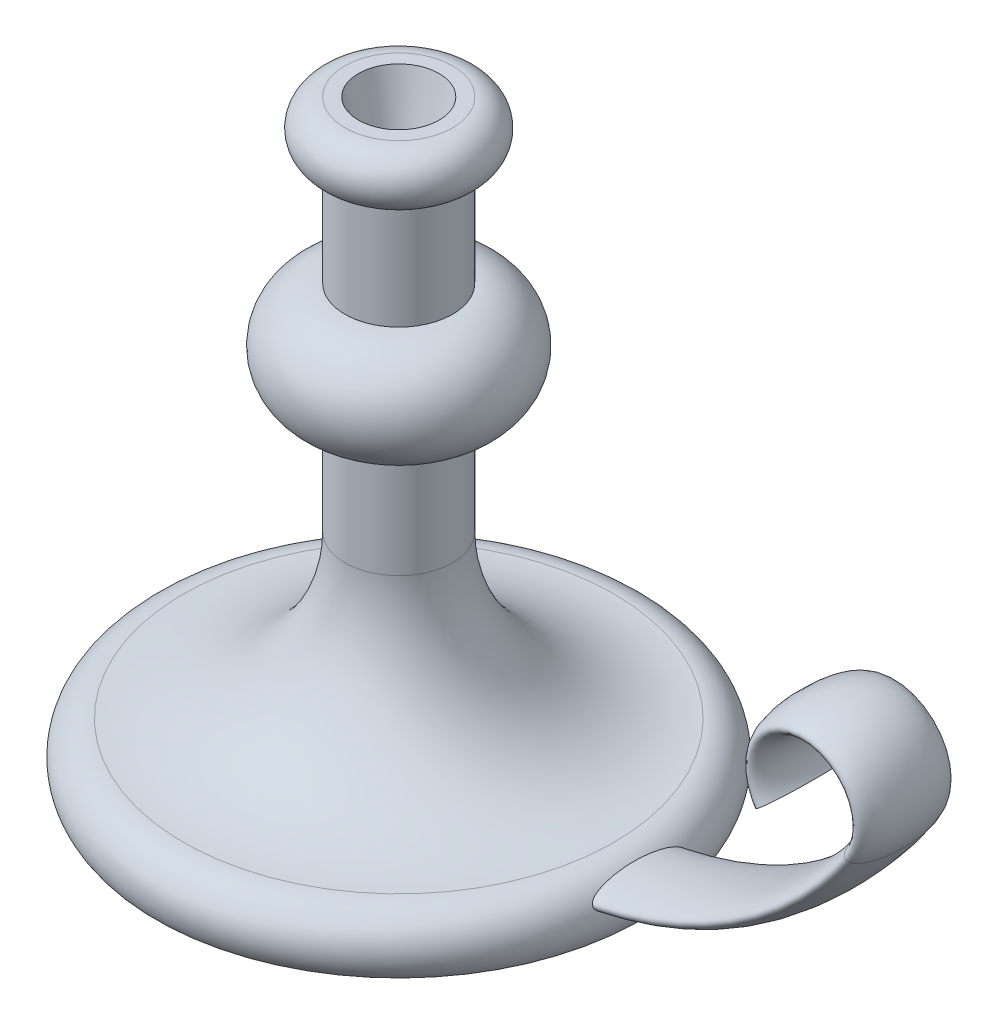
ISO-10303-21;
HEADER;
FILE_DESCRIPTION(('STEP AP214'),'2;1');
FILE_NAME('part.step','',(''),(''),'','','');
FILE_SCHEMA(('AUTOMOTIVE_DESIGN { 1 0 10303 214 1 1 1 1 }'));
ENDSEC;
DATA;
#1=APPLICATION_CONTEXT('core data for automotive mechanical design processes');
#2=APPLICATION_PROTOCOL_DEFINITION('international standard','automotive_design',2000,#1);
#3=PRODUCT_CONTEXT('',#1,'mechanical');
#4=PRODUCT('Part','Part','',(#3));
#5=PRODUCT_RELATED_PRODUCT_CATEGORY('part','',(#4));
#6=PRODUCT_DEFINITION_FORMATION('','',#4);
#7=PRODUCT_DEFINITION_CONTEXT('part definition',#1,'design');
#8=PRODUCT_DEFINITION('design','',#6,#7);
#9=PRODUCT_DEFINITION_SHAPE('','',#8);
#10=(LENGTH_UNIT() NAMED_UNIT(*) SI_UNIT(.MILLI.,.METRE.));
#11=(NAMED_UNIT(*) PLANE_ANGLE_UNIT() SI_UNIT($,.RADIAN.));
#12=(NAMED_UNIT(*) SI_UNIT($,.STERADIAN.) SOLID_ANGLE_UNIT());
#13=UNCERTAINTY_MEASURE_WITH_UNIT(LENGTH_MEASURE(1.E-05),#10,'distance_accuracy_value','');
#14=(GEOMETRIC_REPRESENTATION_CONTEXT(3) GLOBAL_UNCERTAINTY_ASSIGNED_CONTEXT((#13)) GLOBAL_UNIT_ASSIGNED_CONTEXT((#10,
#11,#12)) REPRESENTATION_CONTEXT('',''));
#15=CARTESIAN_POINT('',(0.,0.,0.));
#16=DIRECTION('',(0.,0.,1.));
#17=DIRECTION('',(1.,0.,0.));
#18=AXIS2_PLACEMENT_3D('',#15,#16,#17);
#19=CARTESIAN_POINT('',(0.,0.,0.));
#20=DIRECTION('',(0.,-1.,0.));
#21=DIRECTION('',(0.,0.,-1.));
#22=AXIS2_PLACEMENT_3D('',#19,#20,#21);
#23=PLANE('',#22);
#24=CARTESIAN_POINT('',(0.,0.,0.));
#25=DIRECTION('',(0.,-1.,0.));
#26=DIRECTION('',(0.,0.,-1.));
#27=AXIS2_PLACEMENT_3D('',#24,#25,#26);
#28=CIRCLE('',#27,90.);
#29=CARTESIAN_POINT('',(0.,0.,-90.));
#30=VERTEX_POINT('',#29);
#31=EDGE_CURVE('E67',#30,#30,#28,.T.);
#32=ORIENTED_EDGE('',*,*,#31,.T.);
#33=EDGE_LOOP('',(#32));
#34=FACE_BOUND('',#33,.T.);
#35=ADVANCED_FACE('F35',(#34),#23,.T.);
#36=CARTESIAN_POINT('',(0.,220.,0.));
#37=DIRECTION('',(0.,1.,0.));
#38=DIRECTION('',(0.,0.,1.));
#39=AXIS2_PLACEMENT_3D('',#36,#37,#38);
#40=PLANE('',#39);
#41=CARTESIAN_POINT('',(0.,220.,0.));
#42=DIRECTION('',(0.,1.,0.));
#43=DIRECTION('',(0.,0.,1.));
#44=AXIS2_PLACEMENT_3D('',#41,#42,#43);
#45=CIRCLE('',#44,15.);
#46=CARTESIAN_POINT('',(0.,220.,15.));
#47=VERTEX_POINT('',#46);
#48=EDGE_CURVE('E122',#47,#47,#45,.T.);
#49=ORIENTED_EDGE('',*,*,#48,.F.);
#50=EDGE_LOOP('',(#49));
#51=FACE_BOUND('',#50,.T.);
#52=CARTESIAN_POINT('',(0.,220.,0.));
#53=DIRECTION('',(0.,-1.,0.));
#54=DIRECTION('',(0.,0.,-1.));
#55=AXIS2_PLACEMENT_3D('',#52,#53,#54);
#56=CIRCLE('',#55,20.);
#57=CARTESIAN_POINT('',(0.,220.,-20.));
#58=VERTEX_POINT('',#57);
#59=EDGE_CURVE('E45',#58,#58,#56,.T.);
#60=ORIENTED_EDGE('',*,*,#59,.F.);
#61=EDGE_LOOP('',(#60));
#62=FACE_BOUND('',#61,.T.);
#63=ADVANCED_FACE('F110',(#51,#62),#40,.T.);
#64=CARTESIAN_POINT('',(0.,210.,0.));
#65=DIRECTION('',(0.,-1.,0.));
#66=DIRECTION('',(0.,0.,-1.));
#67=AXIS2_PLACEMENT_3D('',#64,#65,#66);
#68=TOROIDAL_SURFACE('',#67,20.,10.);
#69=ORIENTED_EDGE('',*,*,#59,.T.);
#70=EDGE_LOOP('',(#69));
#71=FACE_BOUND('',#70,.T.);
#72=CARTESIAN_POINT('',(0.,200.,0.));
#73=DIRECTION('',(0.,-1.,0.));
#74=DIRECTION('',(0.,0.,-1.));
#75=AXIS2_PLACEMENT_3D('',#72,#73,#74);
#76=CIRCLE('',#75,20.);
#77=CARTESIAN_POINT('',(0.,200.,-20.));
#78=VERTEX_POINT('',#77);
#79=EDGE_CURVE('E49',#78,#78,#76,.T.);
#80=ORIENTED_EDGE('',*,*,#79,.F.);
#81=EDGE_LOOP('',(#80));
#82=FACE_BOUND('',#81,.T.);
#83=ADVANCED_FACE('F107',(#71,#82),#68,.T.);
#84=CARTESIAN_POINT('',(0.,0.,0.));
#85=DIRECTION('',(0.,-1.,0.));
#86=DIRECTION('',(0.,0.,-1.));
#87=AXIS2_PLACEMENT_3D('',#84,#85,#86);
#88=CYLINDRICAL_SURFACE('',#87,20.);
#89=ORIENTED_EDGE('',*,*,#79,.T.);
#90=EDGE_LOOP('',(#89));
#91=FACE_BOUND('',#90,.T.);
#92=CARTESIAN_POINT('',(0.,160.,0.));
#93=DIRECTION('',(0.,-1.,0.));
#94=DIRECTION('',(0.,0.,-1.));
#95=AXIS2_PLACEMENT_3D('',#92,#93,#94);
#96=CIRCLE('',#95,20.);
#97=CARTESIAN_POINT('',(0.,160.,-20.));
#98=VERTEX_POINT('',#97);
#99=EDGE_CURVE('E53',#98,#98,#96,.T.);
#100=ORIENTED_EDGE('',*,*,#99,.F.);
#101=EDGE_LOOP('',(#100));
#102=FACE_BOUND('',#101,.T.);
#103=ADVANCED_FACE('F103',(#91,#102),#88,.T.);
#104=CARTESIAN_POINT('',(0.,140.,0.));
#105=DIRECTION('',(0.,-1.,0.));
#106=DIRECTION('',(0.,0.,-1.));
#107=AXIS2_PLACEMENT_3D('',#104,#105,#106);
#108=TOROIDAL_SURFACE('',#107,20.,20.);
#109=ORIENTED_EDGE('',*,*,#99,.T.);
#110=EDGE_LOOP('',(#109));
#111=FACE_BOUND('',#110,.T.);
#112=CARTESIAN_POINT('',(0.,120.,0.));
#113=DIRECTION('',(0.,-1.,0.));
#114=DIRECTION('',(0.,0.,-1.));
#115=AXIS2_PLACEMENT_3D('',#112,#113,#114);
#116=CIRCLE('',#115,20.);
#117=CARTESIAN_POINT('',(0.,120.,-20.));
#118=VERTEX_POINT('',#117);
#119=EDGE_CURVE('E58',#118,#118,#116,.T.);
#120=ORIENTED_EDGE('',*,*,#119,.F.);
#121=EDGE_LOOP('',(#120));
#122=FACE_BOUND('',#121,.T.);
#123=ADVANCED_FACE('F99',(#111,#122),#108,.T.);
#124=CARTESIAN_POINT('',(0.,0.,0.));
#125=DIRECTION('',(0.,-1.,0.));
#126=DIRECTION('',(0.,0.,-1.));
#127=AXIS2_PLACEMENT_3D('',#124,#125,#126);
#128=CYLINDRICAL_SURFACE('',#127,20.);
#129=ORIENTED_EDGE('',*,*,#119,.T.);
#130=EDGE_LOOP('',(#129));
#131=FACE_BOUND('',#130,.T.);
#132=CARTESIAN_POINT('',(0.,80.,0.));
#133=DIRECTION('',(0.,-1.,0.));
#134=DIRECTION('',(0.,0.,-1.));
#135=AXIS2_PLACEMENT_3D('',#132,#133,#134);
#136=CIRCLE('',#135,20.);
#137=CARTESIAN_POINT('',(0.,80.,-20.));
#138=VERTEX_POINT('',#137);
#139=EDGE_CURVE('E61',#138,#138,#136,.T.);
#140=ORIENTED_EDGE('',*,*,#139,.F.);
#141=EDGE_LOOP('',(#140));
#142=FACE_BOUND('',#141,.T.);
#143=ADVANCED_FACE('F95',(#131,#142),#128,.T.);
#144=CARTESIAN_POINT('',(0.,80.,0.));
#145=DIRECTION('',(0.,-1.,0.));
#146=DIRECTION('',(0.,0.,-1.));
#147=AXIS2_PLACEMENT_3D('',#144,#145,#146);
#148=TOROIDAL_SURFACE('',#147,80.,60.);
#149=ORIENTED_EDGE('',*,*,#139,.T.);
#150=EDGE_LOOP('',(#149));
#151=FACE_BOUND('',#150,.T.);
#152=CARTESIAN_POINT('',(0.,20.,0.));
#153=DIRECTION('',(0.,-1.,0.));
#154=DIRECTION('',(0.,0.,-1.));
#155=AXIS2_PLACEMENT_3D('',#152,#153,#154);
#156=CIRCLE('',#155,80.);
#157=CARTESIAN_POINT('',(0.,20.,-80.));
#158=VERTEX_POINT('',#157);
#159=EDGE_CURVE('E64',#158,#158,#156,.T.);
#160=ORIENTED_EDGE('',*,*,#159,.F.);
#161=EDGE_LOOP('',(#160));
#162=FACE_BOUND('',#161,.T.);
#163=ADVANCED_FACE('F91',(#151,#162),#148,.F.);
#164=CARTESIAN_POINT('',(0.,7.49999999999998,0.));
#165=DIRECTION('',(0.,-1.,0.));
#166=DIRECTION('',(0.,0.,-1.));
#167=AXIS2_PLACEMENT_3D('',#164,#165,#166);
#168=TOROIDAL_SURFACE('',#167,80.,12.5);
#169=CARTESIAN_POINT('',(89.5597422043341,12.9414346567555,-17.5));
#170=CARTESIAN_POINT('',(89.5390682417034,12.9833970763635,-17.499999801476));
#171=CARTESIAN_POINT('',(89.5184948481192,13.0254081758614,-17.4978460786373));
#172=CARTESIAN_POINT('',(89.4777074557659,13.1091783719493,-17.4892930018231));
#173=CARTESIAN_POINT('',(89.4574935851384,13.1509373753176,-17.4828921640349));
#174=CARTESIAN_POINT('',(89.3975656488552,13.275424618129,-17.4575317742508));
#175=CARTESIAN_POINT('',(89.3585930347989,13.3573066164348,-17.4324146791396));
#176=CARTESIAN_POINT('',(89.2734409816765,13.5379175715786,-17.3597432795598));
#177=CARTESIAN_POINT('',(89.2281121247516,13.6353143232492,-17.3079911474061));
#178=CARTESIAN_POINT('',(89.1421571121494,13.8217561384483,-17.188166079603));
#179=CARTESIAN_POINT('',(89.1015411563844,13.9107830112797,-17.1200586894138));
#180=CARTESIAN_POINT('',(89.0298762971165,14.0690143319055,-16.9825248110394));
#181=CARTESIAN_POINT('',(88.9982786842444,14.1392645151032,-16.9145529225411));
#182=CARTESIAN_POINT('',(88.9378306664439,14.274320374163,-16.7722185271802));
#183=CARTESIAN_POINT('',(88.9089824882069,14.3391216321741,-16.6978509317863));
#184=CARTESIAN_POINT('',(88.8535955575884,14.4639952815646,-16.5441752211162));
#185=CARTESIAN_POINT('',(88.8270622241569,14.5240565470721,-16.4648562214599));
#186=CARTESIAN_POINT('',(88.7760324990848,14.6398694069749,-16.3025689169611));
#187=CARTESIAN_POINT('',(88.7515354717387,14.6956223459826,-16.2196017634807));
#188=CARTESIAN_POINT('',(88.7047417294347,14.8022966462375,-16.0524591820992));
#189=CARTESIAN_POINT('',(88.6824111309148,14.8532916472492,-15.9683399173082));
#190=CARTESIAN_POINT('',(88.6391880618339,14.9520793339757,-15.7978736183899));
#191=CARTESIAN_POINT('',(88.6182958325685,14.9998714823562,-15.7115262138021));
#192=CARTESIAN_POINT('',(88.5574287556144,15.1391199588384,-15.4495202070301));
#193=CARTESIAN_POINT('',(88.5193306885353,15.226294697945,-15.2711446093401));
#194=CARTESIAN_POINT('',(88.446993084953,15.3914560839503,-14.9093240436535));
#195=CARTESIAN_POINT('',(88.4127567918463,15.4694350100039,-14.7258749732315));
#196=CARTESIAN_POINT('',(88.3472362016712,15.6180770700464,-14.3544014869797));
#197=CARTESIAN_POINT('',(88.3159681826398,15.6887000486784,-14.166358238278));
#198=CARTESIAN_POINT('',(88.2560646079385,15.8232632193263,-13.7877426015726));
#199=CARTESIAN_POINT('',(88.2274261580788,15.8872107694165,-13.5971732648848));
#200=CARTESIAN_POINT('',(88.1723521282147,16.0093779596915,-13.2139752998444));
#201=CARTESIAN_POINT('',(88.1459158137056,16.0675995109175,-13.021347382498));
#202=CARTESIAN_POINT('',(88.0881587196921,16.1938504755766,-12.5829461756592));
#203=CARTESIAN_POINT('',(88.057408826797,16.260370117645,-12.3366637905584));
#204=CARTESIAN_POINT('',(87.9985123187221,16.3864590847677,-11.8420048197331));
#205=CARTESIAN_POINT('',(87.9703659750279,16.4460276851697,-11.5936280185528));
#206=CARTESIAN_POINT('',(87.9163482586829,16.559094633045,-11.0949310622541));
#207=CARTESIAN_POINT('',(87.8904797303633,16.6125854146131,-10.8446088905714));
#208=CARTESIAN_POINT('',(87.8408483965671,16.7140512465656,-10.342637064626));
#209=CARTESIAN_POINT('',(87.8170856939001,16.7620260276842,-10.0909873461851));
#210=CARTESIAN_POINT('',(87.7486691228052,16.8985839230831,-9.33377768592072));
#211=CARTESIAN_POINT('',(87.7069540377653,16.9796608720201,-8.82658708533029));
#212=CARTESIAN_POINT('',(87.6306961124076,17.1248455016837,-7.80916406760143));
#213=CARTESIAN_POINT('',(87.5961551600074,17.1889487168834,-7.29893088603628));
#214=CARTESIAN_POINT('',(87.5339911377832,17.3022548727762,-6.2755853599667));
#215=CARTESIAN_POINT('',(87.5063790759952,17.3514341291622,-5.76246974165443));
#216=CARTESIAN_POINT('',(87.4581556376937,17.4361006629321,-4.73533825840234));
#217=CARTESIAN_POINT('',(87.4375369377591,17.4716022688271,-4.22132390532715));
#218=CARTESIAN_POINT('',(87.4033485965416,17.5298933049627,-3.19263203564195));
#219=CARTESIAN_POINT('',(87.3897750436296,17.5526897899013,-2.67795504642744));
#220=CARTESIAN_POINT('',(87.3697503063743,17.5861573346741,-1.64816415678622));
#221=CARTESIAN_POINT('',(87.3632979000101,17.5968304749383,-1.13305034650811));
#222=CARTESIAN_POINT('',(87.3567446403376,17.60768667733,0.0451925107306945));
#223=CARTESIAN_POINT('',(87.3589979794371,17.6039802512045,0.708375187513185));
#224=CARTESIAN_POINT('',(87.375360353613,17.5767998431173,2.03444017536841));
#225=CARTESIAN_POINT('',(87.3894738801435,17.5533183723369,2.69732227744603));
#226=CARTESIAN_POINT('',(87.4294012787108,17.4856044911544,4.02207693580474));
#227=CARTESIAN_POINT('',(87.4552221149226,17.441359729014,4.6839486555798));
#228=CARTESIAN_POINT('',(87.5182601373714,17.3304493690438,6.00273083681833));
#229=CARTESIAN_POINT('',(87.5554327085335,17.2638714468587,6.65965058375361));
#230=CARTESIAN_POINT('',(87.6198336832518,17.1447808230944,7.64196457807097));
#231=CARTESIAN_POINT('',(87.6427357061841,17.1018902548717,7.96882803392433));
#232=CARTESIAN_POINT('',(87.6915021526185,17.0091104096814,8.62133363379357));
#233=CARTESIAN_POINT('',(87.7173664470652,16.9592214375874,8.94697583037738));
#234=CARTESIAN_POINT('',(87.7721755297608,16.8517641144646,9.59646350792374));
#235=CARTESIAN_POINT('',(87.8011178051596,16.794202018156,9.92031023084867));
#236=CARTESIAN_POINT('',(87.8623401784717,16.6704243890001,10.5660151582716));
#237=CARTESIAN_POINT('',(87.894620013366,16.6042095379317,10.8878735173489));
#238=CARTESIAN_POINT('',(87.9634236652184,16.4608004427522,11.5338084513007));
#239=CARTESIAN_POINT('',(88.0000038204031,16.3834565668024,11.8578460140793));
#240=CARTESIAN_POINT('',(88.0776704479077,16.2167402960612,12.5024294932677));
#241=CARTESIAN_POINT('',(88.1187582871155,16.127364250818,12.8229743179846));
#242=CARTESIAN_POINT('',(88.1845991136114,15.9822640377111,13.3001792679787));
#243=CARTESIAN_POINT('',(88.2072711562738,15.9320048353494,13.4587947763661));
#244=CARTESIAN_POINT('',(88.2542087743505,15.8273740345264,13.774420861784));
#245=CARTESIAN_POINT('',(88.2784742329895,15.7730027373803,13.9314315554528));
#246=CARTESIAN_POINT('',(88.3288329339647,15.659636306534,14.2433947335172));
#247=CARTESIAN_POINT('',(88.3549252454499,15.6006435258594,14.3983482189403));
#248=CARTESIAN_POINT('',(88.4092696388298,15.4773352517475,14.7057236901231));
#249=CARTESIAN_POINT('',(88.4375213946571,15.4130205617768,14.8581460538578));
#250=CARTESIAN_POINT('',(88.4968507719838,15.2776562950136,15.1609091928646));
#251=CARTESIAN_POINT('',(88.5279487218456,15.2065580859205,15.3112244481851));
#252=CARTESIAN_POINT('',(88.5933850994805,15.0568677679758,15.6074204461973));
#253=CARTESIAN_POINT('',(88.6277241675823,14.9782741782736,15.7533003050553));
#254=CARTESIAN_POINT('',(88.7002441190654,14.8125407512935,16.037974136376));
#255=CARTESIAN_POINT('',(88.738399640097,14.7254574196192,16.1768067090663));
#256=CARTESIAN_POINT('',(88.799488908187,14.586604220834,16.3782369433223));
#257=CARTESIAN_POINT('',(88.8204977413199,14.5389415031657,16.4442523217264));
#258=CARTESIAN_POINT('',(88.8639845053439,14.4405581400321,16.5734496387408));
#259=CARTESIAN_POINT('',(88.8864621846818,14.3898380182895,16.6366320594117));
#260=CARTESIAN_POINT('',(88.9422432981287,14.2644224068526,16.783587684286));
#261=CARTESIAN_POINT('',(88.9763364041364,14.1881224618919,16.8657235531471));
#262=CARTESIAN_POINT('',(89.0483213192221,14.0281384901648,17.0203903295087));
#263=CARTESIAN_POINT('',(89.0862061390436,13.9444680822862,17.0929383574402));
#264=CARTESIAN_POINT('',(89.1670311583562,13.7675914637822,17.2256585134368));
#265=CARTESIAN_POINT('',(89.210034571423,13.6742683967968,17.2856436508907));
#266=CARTESIAN_POINT('',(89.2779863638657,13.5285260537463,17.3610498966374));
#267=CARTESIAN_POINT('',(89.3011904906557,13.479029598199,17.383743783023));
#268=CARTESIAN_POINT('',(89.3486811224822,13.3783655416212,17.4235815208147));
#269=CARTESIAN_POINT('',(89.3729671592226,13.3271986661323,17.44072774743));
#270=CARTESIAN_POINT('',(89.4344831171654,13.1984825422761,17.4755813984573));
#271=CARTESIAN_POINT('',(89.4722908092761,13.1201458143819,17.4895469950749));
#272=CARTESIAN_POINT('',(89.5490629639977,12.9628453353433,17.5023227338009));
#273=CARTESIAN_POINT('',(89.5880269032799,12.8838818793684,17.5011396310453));
#274=CARTESIAN_POINT('',(89.6659197904113,12.7278461407127,17.4839019863864));
#275=CARTESIAN_POINT('',(89.7048486189824,12.6507699944109,17.467880990987));
#276=CARTESIAN_POINT('',(89.781819349858,12.5001197626222,17.4227133423484));
#277=CARTESIAN_POINT('',(89.8198603575277,12.4265491378837,17.3935540037518));
#278=CARTESIAN_POINT('',(89.9134049221883,12.247653419093,17.3068893145738));
#279=CARTESIAN_POINT('',(89.9679590616017,12.1451898389995,17.2425093702029));
#280=CARTESIAN_POINT('',(90.0730473029302,11.9508453333021,17.0967607254907));
#281=CARTESIAN_POINT('',(90.1235693401405,11.8589958245563,17.0153434992554));
#282=CARTESIAN_POINT('',(90.2171397045068,11.6912868202035,16.8474453840366));
#283=CARTESIAN_POINT('',(90.2604644261221,11.6147475285799,16.7617815283364));
#284=CARTESIAN_POINT('',(90.3441827817374,11.468646855349,16.5833011975348));
#285=CARTESIAN_POINT('',(90.384573670957,11.399091985415,16.4904781877917));
#286=CARTESIAN_POINT('',(90.4628381757607,11.2658377500069,16.2994188011792));
#287=CARTESIAN_POINT('',(90.5007060129814,11.2021517058665,16.2011708808838));
#288=CARTESIAN_POINT('',(90.5741373771336,11.0799532151557,16.0007631564033));
#289=CARTESIAN_POINT('',(90.6097017753882,11.021438809217,15.8986048549415));
#290=CARTESIAN_POINT('',(90.6798506810761,10.9071528014035,15.6881130904024));
#291=CARTESIAN_POINT('',(90.7143737156143,10.8515162836067,15.5796863139968));
#292=CARTESIAN_POINT('',(90.7815268547155,10.7443116806194,15.3602532814326));
#293=CARTESIAN_POINT('',(90.814156622239,10.6927443192356,15.2492465708903));
#294=CARTESIAN_POINT('',(90.8777648134723,10.5931040659517,15.0249916383652));
#295=CARTESIAN_POINT('',(90.9087405253404,10.5450368683665,14.9117401290199));
#296=CARTESIAN_POINT('',(90.96914719828,10.4520756013817,14.6835311743069));
#297=CARTESIAN_POINT('',(90.9985780215579,10.4071818149055,14.5685735779367));
#298=CARTESIAN_POINT('',(91.0847991405961,10.2766779068805,14.2214202083251));
#299=CARTESIAN_POINT('',(91.1394751820618,10.1953120661666,13.987097329798));
#300=CARTESIAN_POINT('',(91.244271100709,10.0414382528756,13.5131955707482));
#301=CARTESIAN_POINT('',(91.2943656433977,9.96897885186179,13.2735956051643));
#302=CARTESIAN_POINT('',(91.3902100238888,9.83200733703086,12.7915919671252));
#303=CARTESIAN_POINT('',(91.4359646930153,9.76748636147134,12.5491917575603));
#304=CARTESIAN_POINT('',(91.5236096481373,9.64522219888297,12.062092500516));
#305=CARTESIAN_POINT('',(91.5655011282618,9.58747691594372,11.8173941893333));
#306=CARTESIAN_POINT('',(91.6521116127008,9.46924027933387,11.2872469347004));
#307=CARTESIAN_POINT('',(91.696229570502,9.40975960214578,11.0014751279409));
#308=CARTESIAN_POINT('',(91.7801283472634,9.29775188889401,10.4279264531572));
#309=CARTESIAN_POINT('',(91.8199088096845,9.2452254243858,10.1401494223705));
#310=CARTESIAN_POINT('',(91.8954614399631,9.14632559184978,9.56268010523268));
#311=CARTESIAN_POINT('',(91.9312290206073,9.09995925467326,9.2729860199318));
#312=CARTESIAN_POINT('',(91.9989276864051,9.01286744655816,8.69230014877871));
#313=CARTESIAN_POINT('',(92.0308586021374,8.97214222471063,8.40130830620753));
#314=CARTESIAN_POINT('',(92.1212362536805,8.85762649139604,7.5260973045339));
#315=CARTESIAN_POINT('',(92.174185893232,8.7916021483044,6.94027690542071));
#316=CARTESIAN_POINT('',(92.2664432393142,8.67757998740644,5.76570323768209));
#317=CARTESIAN_POINT('',(92.3057471215834,8.62958722269087,5.17694919371124));
#318=CARTESIAN_POINT('',(92.3712614806838,8.55005786852718,3.9984626776347));
#319=CARTESIAN_POINT('',(92.3974906208575,8.51849781956343,3.4087328127574));
#320=CARTESIAN_POINT('',(92.4372887662621,8.47075403181954,2.22876713111036));
#321=CARTESIAN_POINT('',(92.4508691565619,8.45455646511447,1.63853224889435));
#322=CARTESIAN_POINT('',(92.4655827970144,8.43701196328765,0.458012213432618));
#323=CARTESIAN_POINT('',(92.4667228078028,8.43565696207804,-0.132272738160774));
#324=CARTESIAN_POINT('',(92.4565896588572,8.447732923378,-1.31245514856273));
#325=CARTESIAN_POINT('',(92.445319430779,8.46116039384198,-1.90235266596246));
#326=CARTESIAN_POINT('',(92.4152323530391,8.4972012789458,-2.91293122105286));
#327=CARTESIAN_POINT('',(92.3994886339014,8.51609771327363,-3.33384169729751));
#328=CARTESIAN_POINT('',(92.3614792935739,8.56194763892572,-4.17492724053353));
#329=CARTESIAN_POINT('',(92.339213804888,8.58890096655698,-4.59510232229158));
#330=CARTESIAN_POINT('',(92.2880200589725,8.65128092003976,-5.43403090748728));
#331=CARTESIAN_POINT('',(92.2590979156972,8.68669977168147,-5.85278535977895));
#332=CARTESIAN_POINT('',(92.1943469782244,8.76665027127293,-6.68888197531432));
#333=CARTESIAN_POINT('',(92.158518488468,8.81118151754133,-7.10622419998606));
#334=CARTESIAN_POINT('',(92.0913883463776,8.89546537403068,-7.81486574097347));
#335=CARTESIAN_POINT('',(92.0619223972651,8.93268360128682,-8.10664239638793));
#336=CARTESIAN_POINT('',(91.9992751831052,9.01244031978519,-8.68906573699721));
#337=CARTESIAN_POINT('',(91.9660940114543,9.05497867728845,-8.97971245040752));
#338=CARTESIAN_POINT('',(91.8958362735734,9.14586079320896,-9.55954014431348));
#339=CARTESIAN_POINT('',(91.8587608402576,9.19420286379852,-9.84872152558046));
#340=CARTESIAN_POINT('',(91.7804640728025,9.2973342433155,-10.4253680209724));
#341=CARTESIAN_POINT('',(91.7392428979805,9.35212330450444,-10.7128332006001));
#342=CARTESIAN_POINT('',(91.6651852642276,9.45169652539748,-11.200911429586));
#343=CARTESIAN_POINT('',(91.6334740038725,9.49464812309938,-11.4020698755173));
#344=CARTESIAN_POINT('',(91.5676939042944,9.58452467571737,-11.8031075357987));
#345=CARTESIAN_POINT('',(91.5336251409549,9.63144950275361,-12.0029867910973));
#346=CARTESIAN_POINT('',(91.4629103530464,9.72978070273008,-12.401460723723));
#347=CARTESIAN_POINT('',(91.4262611401123,9.78119263934492,-12.6000534686673));
#348=CARTESIAN_POINT('',(91.3502044219451,9.8890057064063,-12.9953470629678));
#349=CARTESIAN_POINT('',(91.3107970144941,9.9454066600035,-13.1920479791113));
#350=CARTESIAN_POINT('',(91.2276212473519,10.0658223958325,-13.5894074367523));
#351=CARTESIAN_POINT('',(91.1837532035457,10.130024128161,-13.7899888884133));
#352=CARTESIAN_POINT('',(91.0923799134045,10.2655141547642,-14.1878967143493));
#353=CARTESIAN_POINT('',(91.0448751095633,10.3368015872177,-14.3852234810903));
#354=CARTESIAN_POINT('',(90.9457925667065,10.4876709266039,-14.7751386376054));
#355=CARTESIAN_POINT('',(90.8942241714177,10.5672339324163,-14.9677366350376));
#356=CARTESIAN_POINT('',(90.7862143447492,10.7366119201263,-15.3468982086288));
#357=CARTESIAN_POINT('',(90.7297756979348,10.8264210531411,-15.5334651502539));
#358=CARTESIAN_POINT('',(90.6212033814536,11.0023988323104,-15.8665064968282));
#359=CARTESIAN_POINT('',(90.5700064097134,11.0865232525138,-16.0143454854363));
#360=CARTESIAN_POINT('',(90.4894948368559,11.2210719601969,-16.2297682663));
#361=CARTESIAN_POINT('',(90.4620005609562,11.2673801193677,-16.3006068507229));
#362=CARTESIAN_POINT('',(90.4056638817239,11.3631027215157,-16.4395882553736));
#363=CARTESIAN_POINT('',(90.3768217919399,11.4125164429441,-16.5077316958424));
#364=CARTESIAN_POINT('',(90.3173000187947,11.5154431106489,-16.641468823249));
#365=CARTESIAN_POINT('',(90.286602693187,11.5689974830661,-16.7070230259536));
#366=CARTESIAN_POINT('',(90.2235248416832,11.6801460587709,-16.8338288983837));
#367=CARTESIAN_POINT('',(90.1911437589218,11.7377416008142,-16.8950791287147));
#368=CARTESIAN_POINT('',(90.1246746009041,11.8572287345119,-17.0118342639414));
#369=CARTESIAN_POINT('',(90.0905922975452,11.9191060427909,-17.0673568649606));
#370=CARTESIAN_POINT('',(90.0205945500705,12.0476162041329,-17.1711750807915));
#371=CARTESIAN_POINT('',(89.984681093655,12.1142439306971,-17.2194783172385));
#372=CARTESIAN_POINT('',(89.9072691914899,12.2595601926783,-17.3112578352755));
#373=CARTESIAN_POINT('',(89.8655734433111,12.3387868393102,-17.3537501287496));
#374=CARTESIAN_POINT('',(89.8018195982608,12.461562408861,-17.4064482222621));
#375=CARTESIAN_POINT('',(89.7803859732791,12.5031053112518,-17.4221652201557));
#376=CARTESIAN_POINT('',(89.7372110357339,12.5873443592004,-17.4495428289006));
#377=CARTESIAN_POINT('',(89.7154698658732,12.630039977739,-17.4612052607456));
#378=CARTESIAN_POINT('',(89.6713740740659,12.7172109602892,-17.4803130763981));
#379=CARTESIAN_POINT('',(89.6490160377538,12.7617048684941,-17.4876666954991));
#380=CARTESIAN_POINT('',(89.604313979933,12.851258529829,-17.4975110322341));
#381=CARTESIAN_POINT('',(89.5819699650799,12.8963184572139,-17.5000002134446));
#382=CARTESIAN_POINT('',(89.5597422043341,12.9414346567555,-17.5));
#383=B_SPLINE_CURVE_WITH_KNOTS('',3,(#169,#170,#171,#172,#173,#174,#175,#176,#177,#178,#179,
#180,#181,#182,#183,#184,#185,#186,#187,#188,#189,#190,#191,#192,#193,#194,#195,#196,#197,#198,
#199,#200,#201,#202,#203,#204,#205,#206,#207,#208,#209,#210,#211,#212,#213,#214,#215,#216,#217,
#218,#219,#220,#221,#222,#223,#224,#225,#226,#227,#228,#229,#230,#231,#232,#233,#234,#235,#236,
#237,#238,#239,#240,#241,#242,#243,#244,#245,#246,#247,#248,#249,#250,#251,#252,#253,#254,#255,
#256,#257,#258,#259,#260,#261,#262,#263,#264,#265,#266,#267,#268,#269,#270,#271,#272,#273,#274,
#275,#276,#277,#278,#279,#280,#281,#282,#283,#284,#285,#286,#287,#288,#289,#290,#291,#292,#293,
#294,#295,#296,#297,#298,#299,#300,#301,#302,#303,#304,#305,#306,#307,#308,#309,#310,#311,#312,
#313,#314,#315,#316,#317,#318,#319,#320,#321,#322,#323,#324,#325,#326,#327,#328,#329,#330,#331,
#332,#333,#334,#335,#336,#337,#338,#339,#340,#341,#342,#343,#344,#345,#346,#347,#348,#349,#350,
#351,#352,#353,#354,#355,#356,#357,#358,#359,#360,#361,#362,#363,#364,#365,#366,#367,#368,#369,
#370,#371,#372,#373,#374,#375,#376,#377,#378,#379,#380,#381,#382),.UNSPECIFIED.,.T.,.F.,(4,2,2,
2,2,2,2,2,2,2,2,2,2,2,2,2,2,2,2,2,2,2,2,2,2,2,2,2,2,2,2,2,2,2,2,2,2,2,2,2,2,2,2,2,2,2,2,2,2,2,2,
2,2,2,2,2,2,2,2,2,2,2,2,2,2,2,2,2,2,2,2,2,2,2,2,2,2,2,2,2,2,2,2,2,2,2,2,2,2,2,2,2,2,2,2,2,2,2,2,
2,2,2,2,2,2,2,4),(0.,0.140282110016988,0.280613256161172,0.561461564225114,0.91722376934169,
1.27374211332866,1.5814964487551,1.88949794489934,2.19820212539501,2.5068095680761,
2.80932632770097,3.11189371339082,3.71792129086055,4.32445412269156,4.9341412751214,
5.54314913395216,6.15195304286646,6.92267401303079,7.69347525989541,8.46522575436385,
9.23701390615431,10.7825344609018,12.3284612151256,13.8768286753819,15.4235696486729,
16.9694509143281,18.5150668584831,20.5042466673046,22.4941801183607,24.4852988514025,
26.4686905809739,27.4599989065246,28.4512640608188,29.4417260743111,30.4321100930462,
31.4373321749629,32.4428599224087,32.9465835692661,33.4502703412874,33.9537023077351,
34.4570584075537,34.9643418345019,35.4717256930972,35.975937258074,36.2281107568747,
36.480241181301,36.8312072460153,37.1815378911048,37.5367612141438,37.7140754934864,
37.8913137556305,38.1543004158645,38.4171698086861,38.6794463357431,38.9419766409762,
39.3379141865763,39.7349951838567,40.1027739065841,40.4708923916075,40.8398268646447,
41.2086209555971,41.5884869463067,41.9684203545984,42.3489586608952,42.7295308511717,
43.4911928834923,44.2568399239618,45.0216243573509,45.7861715944634,46.6716652706007,
47.5572316789104,48.4438002995254,49.3304080552984,51.1055666497558,52.8812223365138,
54.6543360799785,56.4258523069987,58.1964057681876,59.9665410633801,61.231311473211,
62.4960561882711,63.7596438732453,65.0231758703001,65.9099510809668,66.7967040041024,
67.6831996648592,68.5696612713659,69.1939827802223,69.8182842026941,70.4433710180178,
71.0684356843035,71.7136688505314,72.3588236340035,73.0025359817234,73.6458826951339,
74.178256172817,74.4451297056867,74.7119414605352,74.9818957428977,75.2519398816439,
75.5211229919293,75.7900198815175,76.0861439670092,76.2339465299978,76.3816826256297,
76.5324603376663,76.68328566487),.UNSPECIFIED.);
#384=CARTESIAN_POINT('',(89.5597422043341,12.9414346567555,-17.5));
#385=VERTEX_POINT('',#384);
#386=EDGE_CURVE('E10',#385,#385,#383,.T.);
#387=ORIENTED_EDGE('',*,*,#386,.F.);
#388=EDGE_LOOP('',(#387));
#389=FACE_BOUND('',#388,.T.);
#390=ORIENTED_EDGE('',*,*,#159,.T.);
#391=EDGE_LOOP('',(#390));
#392=FACE_BOUND('',#391,.T.);
#393=ORIENTED_EDGE('',*,*,#31,.F.);
#394=EDGE_LOOP('',(#393));
#395=FACE_BOUND('',#394,.T.);
#396=ADVANCED_FACE('F84',(#389,#392,#395),#168,.T.);
#397=CARTESIAN_POINT('',(183.592070943083,75.,0.));
#398=DIRECTION('',(0.566666666666667,0.823947139620551,0.));
#399=DIRECTION('',(0.,0.,-1.));
#400=AXIS2_PLACEMENT_3D('',#397,#398,#399);
#401=ELLIPSE('',#400,17.5,5.);
#402=CARTESIAN_POINT('',(167.113128150672,86.3333333333333,0.));
#403=DIRECTION('',(0.,0.,1.));
#404=AXIS1_PLACEMENT('',#402,#403);
#405=SURFACE_OF_REVOLUTION('',#401,#404);
#406=CARTESIAN_POINT('',(183.592070943083,75.,-17.5));
#407=VERTEX_POINT('',#406);
#408=EDGE_CURVE('E73',#407,#407,#401,.T.);
#409=ORIENTED_EDGE('',*,*,#408,.T.);
#410=EDGE_LOOP('',(#409));
#411=FACE_BOUND('',#410,.T.);
#412=CARTESIAN_POINT('',(150.634185358261,74.9999999999998,0.));
#413=DIRECTION('',(0.566666666666681,-0.823947139620542,0.));
#414=DIRECTION('',(0.,0.,-1.));
#415=AXIS2_PLACEMENT_3D('',#412,#413,#414);
#416=ELLIPSE('',#415,17.5,5.);
#417=CARTESIAN_POINT('',(150.634185358261,74.9999999999998,-17.5));
#418=VERTEX_POINT('',#417);
#419=EDGE_CURVE('E70',#418,#418,#416,.T.);
#420=ORIENTED_EDGE('',*,*,#419,.F.);
#421=EDGE_LOOP('',(#420));
#422=FACE_BOUND('',#421,.T.);
#423=ADVANCED_FACE('F81',(#411,#422),#405,.F.);
#424=CARTESIAN_POINT('',(60.,10.,0.));
#425=DIRECTION('',(1.,0.,0.));
#426=DIRECTION('',(0.,0.,-1.));
#427=AXIS2_PLACEMENT_3D('',#424,#425,#426);
#428=ELLIPSE('',#427,17.5,5.);
#429=CARTESIAN_POINT('',(60.,160.,0.));
#430=DIRECTION('',(0.,0.,1.));
#431=AXIS1_PLACEMENT('',#429,#430);
#432=SURFACE_OF_REVOLUTION('',#428,#431);
#433=ORIENTED_EDGE('',*,*,#386,.T.);
#434=EDGE_LOOP('',(#433));
#435=FACE_BOUND('',#434,.T.);
#436=ORIENTED_EDGE('',*,*,#408,.F.);
#437=EDGE_LOOP('',(#436));
#438=FACE_BOUND('',#437,.T.);
#439=ADVANCED_FACE('F83',(#435,#438),#432,.F.);
#440=CARTESIAN_POINT('',(150.634185358261,74.9999999999998,0.));
#441=DIRECTION('',(0.566666666666681,-0.823947139620542,0.));
#442=DIRECTION('',(0.,0.,-1.));
#443=AXIS2_PLACEMENT_3D('',#440,#441,#442);
#444=PLANE('',#443);
#445=ORIENTED_EDGE('',*,*,#419,.T.);
#446=EDGE_LOOP('',(#445));
#447=FACE_BOUND('',#446,.T.);
#448=ADVANCED_FACE('F132',(#447),#444,.T.);
#449=CARTESIAN_POINT('',(0.,220.,0.));
#450=DIRECTION('',(0.,1.,0.));
#451=DIRECTION('',(0.,0.,1.));
#452=AXIS2_PLACEMENT_3D('',#449,#450,#451);
#453=CONICAL_SURFACE('',#452,15.,0.26179938779915);
#454=CARTESIAN_POINT('',(0.,195.,0.));
#455=DIRECTION('',(0.,1.,0.));
#456=DIRECTION('',(0.,0.,1.));
#457=AXIS2_PLACEMENT_3D('',#454,#455,#456);
#458=CIRCLE('',#457,8.30127018922192);
#459=CARTESIAN_POINT('',(0.,195.,8.30127018922192));
#460=VERTEX_POINT('',#459);
#461=EDGE_CURVE('E77',#460,#460,#458,.T.);
#462=ORIENTED_EDGE('',*,*,#461,.F.);
#463=EDGE_LOOP('',(#462));
#464=FACE_BOUND('',#463,.T.);
#465=ORIENTED_EDGE('',*,*,#48,.T.);
#466=EDGE_LOOP('',(#465));
#467=FACE_BOUND('',#466,.T.);
#468=ADVANCED_FACE('F130',(#464,#467),#453,.F.);
#469=CARTESIAN_POINT('',(0.,195.,0.));
#470=DIRECTION('',(0.,1.,0.));
#471=DIRECTION('',(0.,0.,1.));
#472=AXIS2_PLACEMENT_3D('',#469,#470,#471);
#473=PLANE('',#472);
#474=ORIENTED_EDGE('',*,*,#461,.T.);
#475=EDGE_LOOP('',(#474));
#476=FACE_BOUND('',#475,.T.);
#477=ADVANCED_FACE('F128',(#476),#473,.T.);
#478=CLOSED_SHELL('',(#35,#63,#83,#103,#123,#143,#163,#396,#423,#439,#448,#468,#477));
#479=MANIFOLD_SOLID_BREP('B2',#478);
#480=ADVANCED_BREP_SHAPE_REPRESENTATION('',(#18,#479),#14);
#481=SHAPE_DEFINITION_REPRESENTATION(#9,#480);
ENDSEC;
END-ISO-10303-21;
